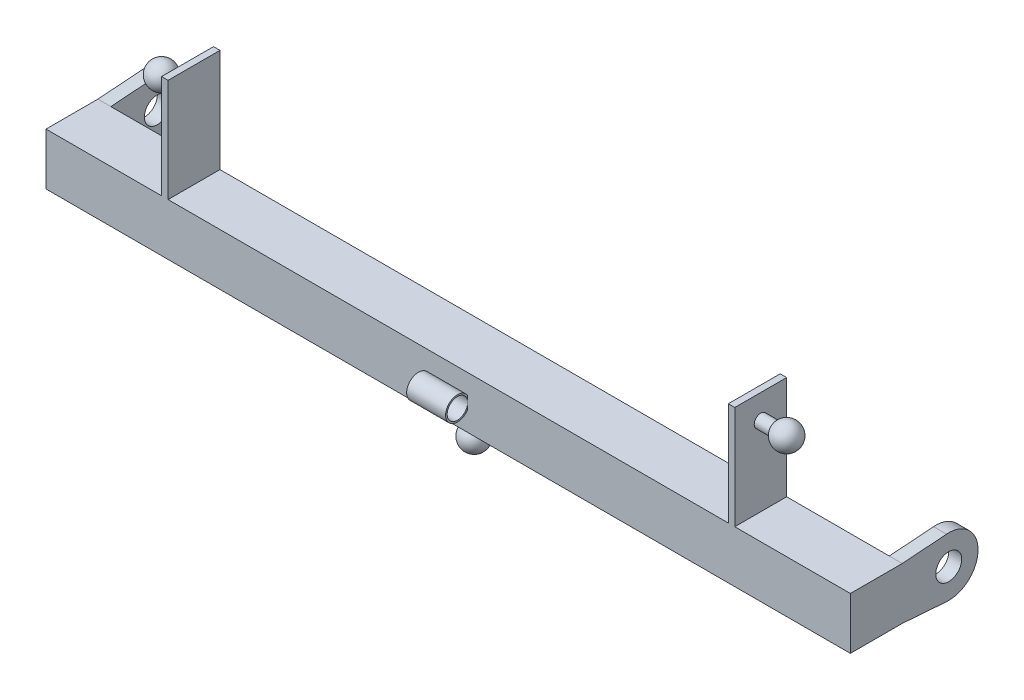
ISO-10303-21;
HEADER;
FILE_DESCRIPTION(('STEP AP214'),'2;1');
FILE_NAME('part.step','',(''),(''),'','','');
FILE_SCHEMA(('AUTOMOTIVE_DESIGN { 1 0 10303 214 1 1 1 1 }'));
ENDSEC;
DATA;
#1=APPLICATION_CONTEXT('core data for automotive mechanical design processes');
#2=APPLICATION_PROTOCOL_DEFINITION('international standard','automotive_design',2000,#1);
#3=PRODUCT_CONTEXT('',#1,'mechanical');
#4=PRODUCT('Part','Part','',(#3));
#5=PRODUCT_RELATED_PRODUCT_CATEGORY('part','',(#4));
#6=PRODUCT_DEFINITION_FORMATION('','',#4);
#7=PRODUCT_DEFINITION_CONTEXT('part definition',#1,'design');
#8=PRODUCT_DEFINITION('design','',#6,#7);
#9=PRODUCT_DEFINITION_SHAPE('','',#8);
#10=(LENGTH_UNIT() NAMED_UNIT(*) SI_UNIT(.MILLI.,.METRE.));
#11=(NAMED_UNIT(*) PLANE_ANGLE_UNIT() SI_UNIT($,.RADIAN.));
#12=(NAMED_UNIT(*) SI_UNIT($,.STERADIAN.) SOLID_ANGLE_UNIT());
#13=UNCERTAINTY_MEASURE_WITH_UNIT(LENGTH_MEASURE(1.E-05),#10,'distance_accuracy_value','');
#14=(GEOMETRIC_REPRESENTATION_CONTEXT(3) GLOBAL_UNCERTAINTY_ASSIGNED_CONTEXT((#13)) GLOBAL_UNIT_ASSIGNED_CONTEXT((#10,
#11,#12)) REPRESENTATION_CONTEXT('',''));
#15=CARTESIAN_POINT('',(0.,0.,0.));
#16=DIRECTION('',(0.,0.,1.));
#17=DIRECTION('',(1.,0.,0.));
#18=AXIS2_PLACEMENT_3D('',#15,#16,#17);
#19=CARTESIAN_POINT('',(381.,25.4,25.4));
#20=DIRECTION('',(0.,-1.,0.));
#21=DIRECTION('',(0.,0.,-1.));
#22=AXIS2_PLACEMENT_3D('',#19,#20,#21);
#23=PLANE('',#22);
#24=DIRECTION('',(0.,0.,-1.));
#25=VECTOR('',#24,1.);
#26=CARTESIAN_POINT('',(280.543,25.4,25.3999999999999));
#27=LINE('',#26,#25);
#28=CARTESIAN_POINT('',(280.543,25.4,25.4));
#29=VERTEX_POINT('',#28);
#30=CARTESIAN_POINT('',(280.543,25.4,-25.4));
#31=VERTEX_POINT('',#30);
#32=EDGE_CURVE('E62',#29,#31,#27,.T.);
#33=ORIENTED_EDGE('',*,*,#32,.F.);
#34=DIRECTION('',(-1.,0.,0.));
#35=VECTOR('',#34,1.);
#36=CARTESIAN_POINT('',(381.,25.4,25.4));
#37=LINE('',#36,#35);
#38=CARTESIAN_POINT('',(393.7,25.3999999999998,25.4000000000002));
#39=VERTEX_POINT('',#38);
#40=EDGE_CURVE('E432',#39,#29,#37,.T.);
#41=ORIENTED_EDGE('',*,*,#40,.F.);
#42=DIRECTION('',(0.,0.,1.));
#43=VECTOR('',#42,1.);
#44=CARTESIAN_POINT('',(393.7,25.3999999999998,25.4000000000002));
#45=LINE('',#44,#43);
#46=CARTESIAN_POINT('',(393.7,25.4000000000002,-25.3999999999998));
#47=VERTEX_POINT('',#46);
#48=EDGE_CURVE('E269',#47,#39,#45,.T.);
#49=ORIENTED_EDGE('',*,*,#48,.F.);
#50=DIRECTION('',(-1.,0.,0.));
#51=VECTOR('',#50,1.);
#52=CARTESIAN_POINT('',(393.7,25.4000000000002,-25.3999999999998));
#53=LINE('',#52,#51);
#54=CARTESIAN_POINT('',(381.,25.4000000000002,-25.3999999999998));
#55=VERTEX_POINT('',#54);
#56=EDGE_CURVE('E291',#47,#55,#53,.T.);
#57=ORIENTED_EDGE('',*,*,#56,.T.);
#58=DIRECTION('',(-1.,0.,0.));
#59=VECTOR('',#58,1.);
#60=CARTESIAN_POINT('',(381.,25.4,-25.4));
#61=LINE('',#60,#59);
#62=EDGE_CURVE('E435',#55,#31,#61,.T.);
#63=ORIENTED_EDGE('',*,*,#62,.T.);
#64=EDGE_LOOP('',(#33,#41,#49,#57,#63));
#65=FACE_BOUND('',#64,.T.);
#66=ADVANCED_FACE('F38',(#65),#23,.F.);
#67=DIRECTION('',(0.,0.,1.));
#68=VECTOR('',#67,1.);
#69=CARTESIAN_POINT('',(274.193,25.4,25.3999999999999));
#70=LINE('',#69,#68);
#71=CARTESIAN_POINT('',(274.193,25.4,-25.4000000000001));
#72=VERTEX_POINT('',#71);
#73=CARTESIAN_POINT('',(274.193,25.4,25.4));
#74=VERTEX_POINT('',#73);
#75=EDGE_CURVE('E313',#72,#74,#70,.T.);
#76=ORIENTED_EDGE('',*,*,#75,.F.);
#77=CARTESIAN_POINT('',(-274.193,25.4,-25.4));
#78=VERTEX_POINT('',#77);
#79=EDGE_CURVE('E436',#72,#78,#61,.T.);
#80=ORIENTED_EDGE('',*,*,#79,.T.);
#81=DIRECTION('',(0.,0.,-1.));
#82=VECTOR('',#81,1.);
#83=CARTESIAN_POINT('',(-274.193,25.4,25.4));
#84=LINE('',#83,#82);
#85=CARTESIAN_POINT('',(-274.193,25.4,25.4));
#86=VERTEX_POINT('',#85);
#87=EDGE_CURVE('E338',#86,#78,#84,.T.);
#88=ORIENTED_EDGE('',*,*,#87,.F.);
#89=EDGE_CURVE('E54',#74,#86,#37,.T.);
#90=ORIENTED_EDGE('',*,*,#89,.F.);
#91=EDGE_LOOP('',(#76,#80,#88,#90));
#92=FACE_BOUND('',#91,.T.);
#93=ADVANCED_FACE('F503',(#92),#23,.F.);
#94=DIRECTION('',(0.,0.,1.));
#95=VECTOR('',#94,1.);
#96=CARTESIAN_POINT('',(-280.543,25.4,25.4));
#97=LINE('',#96,#95);
#98=CARTESIAN_POINT('',(-280.543,25.4,-25.4));
#99=VERTEX_POINT('',#98);
#100=CARTESIAN_POINT('',(-280.543,25.4,25.4));
#101=VERTEX_POINT('',#100);
#102=EDGE_CURVE('E333',#99,#101,#97,.T.);
#103=ORIENTED_EDGE('',*,*,#102,.F.);
#104=CARTESIAN_POINT('',(-381.,25.4,-25.4));
#105=VERTEX_POINT('',#104);
#106=EDGE_CURVE('E434',#99,#105,#61,.T.);
#107=ORIENTED_EDGE('',*,*,#106,.T.);
#108=DIRECTION('',(1.,0.,0.));
#109=VECTOR('',#108,1.);
#110=CARTESIAN_POINT('',(-393.7,25.4000000000002,-25.3999999999998));
#111=LINE('',#110,#109);
#112=CARTESIAN_POINT('',(-393.7,25.4000000000002,-25.3999999999998));
#113=VERTEX_POINT('',#112);
#114=EDGE_CURVE('E253',#113,#105,#111,.T.);
#115=ORIENTED_EDGE('',*,*,#114,.F.);
#116=DIRECTION('',(0.,0.,1.));
#117=VECTOR('',#116,1.);
#118=CARTESIAN_POINT('',(-393.7,25.3999999999998,25.4000000000002));
#119=LINE('',#118,#117);
#120=CARTESIAN_POINT('',(-393.7,25.3999999999998,25.4000000000002));
#121=VERTEX_POINT('',#120);
#122=EDGE_CURVE('E242',#113,#121,#119,.T.);
#123=ORIENTED_EDGE('',*,*,#122,.T.);
#124=EDGE_CURVE('E431',#101,#121,#37,.T.);
#125=ORIENTED_EDGE('',*,*,#124,.F.);
#126=EDGE_LOOP('',(#103,#107,#115,#123,#125));
#127=FACE_BOUND('',#126,.T.);
#128=ADVANCED_FACE('F506',(#127),#23,.F.);
#129=CARTESIAN_POINT('',(381.,-25.4,25.4));
#130=DIRECTION('',(0.,0.,-1.));
#131=DIRECTION('',(-1.,0.,0.));
#132=AXIS2_PLACEMENT_3D('',#129,#130,#131);
#133=PLANE('',#132);
#134=DIRECTION('',(-1.,0.,0.));
#135=VECTOR('',#134,1.);
#136=CARTESIAN_POINT('',(19.05,5.85695157976361,25.4));
#137=LINE('',#136,#135);
#138=CARTESIAN_POINT('',(19.05,5.85695157976361,25.4));
#139=VERTEX_POINT('',#138);
#140=CARTESIAN_POINT('',(-19.05,5.85695157976361,25.4));
#141=VERTEX_POINT('',#140);
#142=EDGE_CURVE('E370',#139,#141,#137,.T.);
#143=ORIENTED_EDGE('',*,*,#142,.F.);
#144=DIRECTION('',(0.,-1.,0.));
#145=VECTOR('',#144,1.);
#146=CARTESIAN_POINT('',(19.05,-25.4,25.4));
#147=LINE('',#146,#145);
#148=CARTESIAN_POINT('',(19.05,0.,25.4));
#149=VERTEX_POINT('',#148);
#150=EDGE_CURVE('E384',#139,#149,#147,.T.);
#151=ORIENTED_EDGE('',*,*,#150,.T.);
#152=CARTESIAN_POINT('',(19.05,-5.85695157976361,25.4));
#153=VERTEX_POINT('',#152);
#154=EDGE_CURVE('E382',#149,#153,#147,.T.);
#155=ORIENTED_EDGE('',*,*,#154,.T.);
#156=DIRECTION('',(-1.,0.,0.));
#157=VECTOR('',#156,1.);
#158=CARTESIAN_POINT('',(19.05,-5.85695157976361,25.4));
#159=LINE('',#158,#157);
#160=CARTESIAN_POINT('',(-19.05,-5.85695157976361,25.4));
#161=VERTEX_POINT('',#160);
#162=EDGE_CURVE('E375',#161,#153,#159,.F.);
#163=ORIENTED_EDGE('',*,*,#162,.F.);
#164=DIRECTION('',(0.,-1.,0.));
#165=VECTOR('',#164,1.);
#166=CARTESIAN_POINT('',(-19.05,-25.4,25.4));
#167=LINE('',#166,#165);
#168=CARTESIAN_POINT('',(-19.05,0.,25.4));
#169=VERTEX_POINT('',#168);
#170=EDGE_CURVE('E378',#169,#161,#167,.T.);
#171=ORIENTED_EDGE('',*,*,#170,.F.);
#172=EDGE_CURVE('E381',#141,#169,#167,.T.);
#173=ORIENTED_EDGE('',*,*,#172,.F.);
#174=EDGE_LOOP('',(#143,#151,#155,#163,#171,#173));
#175=FACE_BOUND('',#174,.T.);
#176=ORIENTED_EDGE('',*,*,#124,.T.);
#177=DIRECTION('',(0.,-1.,0.));
#178=VECTOR('',#177,1.);
#179=CARTESIAN_POINT('',(-393.7,-25.4000000000002,25.3999999999998));
#180=LINE('',#179,#178);
#181=CARTESIAN_POINT('',(-393.7,-25.4000000000002,25.3999999999998));
#182=VERTEX_POINT('',#181);
#183=EDGE_CURVE('E236',#121,#182,#180,.T.);
#184=ORIENTED_EDGE('',*,*,#183,.T.);
#185=DIRECTION('',(-1.,0.,0.));
#186=VECTOR('',#185,1.);
#187=CARTESIAN_POINT('',(381.,-25.4,25.4));
#188=LINE('',#187,#186);
#189=CARTESIAN_POINT('',(393.7,-25.4000000000002,25.3999999999998));
#190=VERTEX_POINT('',#189);
#191=EDGE_CURVE('E429',#190,#182,#188,.T.);
#192=ORIENTED_EDGE('',*,*,#191,.F.);
#193=DIRECTION('',(0.,-1.,0.));
#194=VECTOR('',#193,1.);
#195=CARTESIAN_POINT('',(393.7,-25.4000000000002,25.3999999999998));
#196=LINE('',#195,#194);
#197=EDGE_CURVE('E272',#39,#190,#196,.T.);
#198=ORIENTED_EDGE('',*,*,#197,.F.);
#199=ORIENTED_EDGE('',*,*,#40,.T.);
#200=DIRECTION('',(0.,-1.,0.));
#201=VECTOR('',#200,1.);
#202=CARTESIAN_POINT('',(280.543,126.492,25.3999999999999));
#203=LINE('',#202,#201);
#204=CARTESIAN_POINT('',(280.543,126.492,25.3999999999999));
#205=VERTEX_POINT('',#204);
#206=EDGE_CURVE('E330',#205,#29,#203,.T.);
#207=ORIENTED_EDGE('',*,*,#206,.F.);
#208=DIRECTION('',(1.,0.,0.));
#209=VECTOR('',#208,1.);
#210=CARTESIAN_POINT('',(280.543,126.492,25.3999999999999));
#211=LINE('',#210,#209);
#212=CARTESIAN_POINT('',(274.193,126.492,25.3999999999999));
#213=VERTEX_POINT('',#212);
#214=EDGE_CURVE('E309',#213,#205,#211,.T.);
#215=ORIENTED_EDGE('',*,*,#214,.F.);
#216=DIRECTION('',(0.,-1.,0.));
#217=VECTOR('',#216,1.);
#218=CARTESIAN_POINT('',(274.193,126.492,25.3999999999999));
#219=LINE('',#218,#217);
#220=EDGE_CURVE('E319',#213,#74,#219,.T.);
#221=ORIENTED_EDGE('',*,*,#220,.T.);
#222=ORIENTED_EDGE('',*,*,#89,.T.);
#223=DIRECTION('',(0.,-1.,0.));
#224=VECTOR('',#223,1.);
#225=CARTESIAN_POINT('',(-274.193,126.492,25.4));
#226=LINE('',#225,#224);
#227=CARTESIAN_POINT('',(-274.193,126.492,25.4));
#228=VERTEX_POINT('',#227);
#229=EDGE_CURVE('E354',#228,#86,#226,.T.);
#230=ORIENTED_EDGE('',*,*,#229,.F.);
#231=DIRECTION('',(1.,0.,0.));
#232=VECTOR('',#231,1.);
#233=CARTESIAN_POINT('',(-280.543,126.492,25.4));
#234=LINE('',#233,#232);
#235=CARTESIAN_POINT('',(-280.543,126.492,25.4));
#236=VERTEX_POINT('',#235);
#237=EDGE_CURVE('E337',#236,#228,#234,.T.);
#238=ORIENTED_EDGE('',*,*,#237,.F.);
#239=DIRECTION('',(0.,-1.,0.));
#240=VECTOR('',#239,1.);
#241=CARTESIAN_POINT('',(-280.543,126.492,25.4));
#242=LINE('',#241,#240);
#243=EDGE_CURVE('E357',#236,#101,#242,.T.);
#244=ORIENTED_EDGE('',*,*,#243,.T.);
#245=EDGE_LOOP('',(#176,#184,#192,#198,#199,#207,#215,#221,#222,#230,#238,#244));
#246=FACE_BOUND('',#245,.T.);
#247=ADVANCED_FACE('F461',(#175,#246),#133,.F.);
#248=CARTESIAN_POINT('',(381.,-25.4,-25.4));
#249=DIRECTION('',(0.,0.,1.));
#250=DIRECTION('',(1.,0.,0.));
#251=AXIS2_PLACEMENT_3D('',#248,#249,#250);
#252=PLANE('',#251);
#253=DIRECTION('',(0.,1.,0.));
#254=VECTOR('',#253,1.);
#255=CARTESIAN_POINT('',(-381.,-25.4,-25.4));
#256=LINE('',#255,#254);
#257=CARTESIAN_POINT('',(-381.,-25.3999999999998,-25.4000000000002));
#258=VERTEX_POINT('',#257);
#259=EDGE_CURVE('E420',#258,#105,#256,.T.);
#260=ORIENTED_EDGE('',*,*,#259,.T.);
#261=ORIENTED_EDGE('',*,*,#106,.F.);
#262=DIRECTION('',(0.,-1.,0.));
#263=VECTOR('',#262,1.);
#264=CARTESIAN_POINT('',(-280.543,126.492,-25.4));
#265=LINE('',#264,#263);
#266=CARTESIAN_POINT('',(-280.543,126.492,-25.4));
#267=VERTEX_POINT('',#266);
#268=EDGE_CURVE('E344',#267,#99,#265,.T.);
#269=ORIENTED_EDGE('',*,*,#268,.F.);
#270=DIRECTION('',(-1.,0.,0.));
#271=VECTOR('',#270,1.);
#272=CARTESIAN_POINT('',(-280.543,126.492,-25.4));
#273=LINE('',#272,#271);
#274=CARTESIAN_POINT('',(-274.193,126.492,-25.4));
#275=VERTEX_POINT('',#274);
#276=EDGE_CURVE('E342',#275,#267,#273,.T.);
#277=ORIENTED_EDGE('',*,*,#276,.F.);
#278=DIRECTION('',(0.,-1.,0.));
#279=VECTOR('',#278,1.);
#280=CARTESIAN_POINT('',(-274.193,126.492,-25.4));
#281=LINE('',#280,#279);
#282=EDGE_CURVE('E351',#275,#78,#281,.T.);
#283=ORIENTED_EDGE('',*,*,#282,.T.);
#284=ORIENTED_EDGE('',*,*,#79,.F.);
#285=DIRECTION('',(0.,-1.,0.));
#286=VECTOR('',#285,1.);
#287=CARTESIAN_POINT('',(274.193,126.492,-25.4000000000001));
#288=LINE('',#287,#286);
#289=CARTESIAN_POINT('',(274.193,126.492,-25.4000000000001));
#290=VERTEX_POINT('',#289);
#291=EDGE_CURVE('E324',#290,#72,#288,.T.);
#292=ORIENTED_EDGE('',*,*,#291,.F.);
#293=DIRECTION('',(-1.,0.,0.));
#294=VECTOR('',#293,1.);
#295=CARTESIAN_POINT('',(280.543,126.492,-25.4000000000001));
#296=LINE('',#295,#294);
#297=CARTESIAN_POINT('',(280.543,126.492,-25.4000000000001));
#298=VERTEX_POINT('',#297);
#299=EDGE_CURVE('E315',#298,#290,#296,.T.);
#300=ORIENTED_EDGE('',*,*,#299,.F.);
#301=DIRECTION('',(0.,-1.,0.));
#302=VECTOR('',#301,1.);
#303=CARTESIAN_POINT('',(280.543,126.492,-25.4000000000001));
#304=LINE('',#303,#302);
#305=EDGE_CURVE('E327',#298,#31,#304,.T.);
#306=ORIENTED_EDGE('',*,*,#305,.T.);
#307=ORIENTED_EDGE('',*,*,#62,.F.);
#308=DIRECTION('',(0.,1.,0.));
#309=VECTOR('',#308,1.);
#310=CARTESIAN_POINT('',(381.,-25.4,-25.4));
#311=LINE('',#310,#309);
#312=CARTESIAN_POINT('',(381.,-25.4,-25.4));
#313=VERTEX_POINT('',#312);
#314=EDGE_CURVE('E421',#313,#55,#311,.T.);
#315=ORIENTED_EDGE('',*,*,#314,.F.);
#316=DIRECTION('',(-1.,0.,0.));
#317=VECTOR('',#316,1.);
#318=CARTESIAN_POINT('',(381.,-25.4,-25.4));
#319=LINE('',#318,#317);
#320=EDGE_CURVE('E424',#313,#258,#319,.T.);
#321=ORIENTED_EDGE('',*,*,#320,.T.);
#322=EDGE_LOOP('',(#260,#261,#269,#277,#283,#284,#292,#300,#306,#307,#315,#321));
#323=FACE_BOUND('',#322,.T.);
#324=ADVANCED_FACE('F40',(#323),#252,.F.);
#325=CARTESIAN_POINT('',(381.,-25.4,25.4));
#326=DIRECTION('',(0.,1.,0.));
#327=DIRECTION('',(0.,0.,1.));
#328=AXIS2_PLACEMENT_3D('',#325,#326,#327);
#329=PLANE('',#328);
#330=CARTESIAN_POINT('',(0.,-25.4,0.));
#331=DIRECTION('',(0.,1.,0.));
#332=DIRECTION('',(0.,0.,1.));
#333=AXIS2_PLACEMENT_3D('',#330,#331,#332);
#334=CIRCLE('',#333,6.34999999999999);
#335=CARTESIAN_POINT('',(0.,-25.4,6.34999999999999));
#336=VERTEX_POINT('',#335);
#337=EDGE_CURVE('E300',#336,#336,#334,.T.);
#338=ORIENTED_EDGE('',*,*,#337,.T.);
#339=EDGE_LOOP('',(#338));
#340=FACE_BOUND('',#339,.T.);
#341=ORIENTED_EDGE('',*,*,#191,.T.);
#342=DIRECTION('',(0.,0.,-1.));
#343=VECTOR('',#342,1.);
#344=CARTESIAN_POINT('',(-393.7,-25.3999999999998,-25.4000000000002));
#345=LINE('',#344,#343);
#346=CARTESIAN_POINT('',(-393.7,-25.3999999999998,-25.4000000000002));
#347=VERTEX_POINT('',#346);
#348=EDGE_CURVE('E234',#182,#347,#345,.T.);
#349=ORIENTED_EDGE('',*,*,#348,.T.);
#350=DIRECTION('',(1.,0.,0.));
#351=VECTOR('',#350,1.);
#352=CARTESIAN_POINT('',(-393.7,-25.3999999999998,-25.4000000000002));
#353=LINE('',#352,#351);
#354=EDGE_CURVE('E219',#347,#258,#353,.T.);
#355=ORIENTED_EDGE('',*,*,#354,.T.);
#356=ORIENTED_EDGE('',*,*,#320,.F.);
#357=DIRECTION('',(-1.,0.,0.));
#358=VECTOR('',#357,1.);
#359=CARTESIAN_POINT('',(393.7,-25.3999999999998,-25.4000000000002));
#360=LINE('',#359,#358);
#361=CARTESIAN_POINT('',(393.7,-25.3999999999998,-25.4000000000002));
#362=VERTEX_POINT('',#361);
#363=EDGE_CURVE('E288',#362,#313,#360,.T.);
#364=ORIENTED_EDGE('',*,*,#363,.F.);
#365=DIRECTION('',(0.,0.,-1.));
#366=VECTOR('',#365,1.);
#367=CARTESIAN_POINT('',(393.7,-25.3999999999998,-25.4000000000002));
#368=LINE('',#367,#366);
#369=EDGE_CURVE('E275',#190,#362,#368,.T.);
#370=ORIENTED_EDGE('',*,*,#369,.F.);
#371=EDGE_LOOP('',(#341,#349,#355,#356,#364,#370));
#372=FACE_BOUND('',#371,.T.);
#373=ADVANCED_FACE('F483',(#340,#372),#329,.F.);
#374=CARTESIAN_POINT('',(19.05,0.,35.4106222228962));
#375=DIRECTION('',(1.,0.,0.));
#376=DIRECTION('',(0.,0.,-1.));
#377=AXIS2_PLACEMENT_3D('',#374,#375,#376);
#378=PLANE('',#377);
#379=ORIENTED_EDGE('',*,*,#150,.F.);
#380=CARTESIAN_POINT('',(19.05,0.,35.4106222228962));
#381=DIRECTION('',(1.,0.,0.));
#382=DIRECTION('',(0.,0.,-1.));
#383=AXIS2_PLACEMENT_3D('',#380,#381,#382);
#384=CIRCLE('',#383,11.5981222228962);
#385=EDGE_CURVE('E367',#139,#153,#384,.T.);
#386=ORIENTED_EDGE('',*,*,#385,.T.);
#387=ORIENTED_EDGE('',*,*,#154,.F.);
#388=CARTESIAN_POINT('',(19.05,0.,35.4106222228962));
#389=DIRECTION('',(1.,0.,0.));
#390=DIRECTION('',(0.,0.,-1.));
#391=AXIS2_PLACEMENT_3D('',#388,#389,#390);
#392=CIRCLE('',#391,10.0106222228962);
#393=EDGE_CURVE('E361',#149,#149,#392,.T.);
#394=ORIENTED_EDGE('',*,*,#393,.F.);
#395=EDGE_LOOP('',(#379,#386,#387,#394));
#396=FACE_BOUND('',#395,.T.);
#397=ADVANCED_FACE('F535',(#396),#378,.T.);
#398=CARTESIAN_POINT('',(-19.05,0.,35.4106222228962));
#399=DIRECTION('',(1.,0.,0.));
#400=DIRECTION('',(0.,0.,-1.));
#401=AXIS2_PLACEMENT_3D('',#398,#399,#400);
#402=PLANE('',#401);
#403=CARTESIAN_POINT('',(-19.05,0.,35.4106222228962));
#404=DIRECTION('',(1.,0.,0.));
#405=DIRECTION('',(0.,0.,-1.));
#406=AXIS2_PLACEMENT_3D('',#403,#404,#405);
#407=CIRCLE('',#406,11.5981222228962);
#408=EDGE_CURVE('E364',#141,#161,#407,.T.);
#409=ORIENTED_EDGE('',*,*,#408,.F.);
#410=ORIENTED_EDGE('',*,*,#172,.T.);
#411=CARTESIAN_POINT('',(-19.05,0.,35.4106222228962));
#412=DIRECTION('',(1.,0.,0.));
#413=DIRECTION('',(0.,0.,-1.));
#414=AXIS2_PLACEMENT_3D('',#411,#412,#413);
#415=CIRCLE('',#414,10.0106222228962);
#416=EDGE_CURVE('E360',#169,#169,#415,.T.);
#417=ORIENTED_EDGE('',*,*,#416,.T.);
#418=ORIENTED_EDGE('',*,*,#170,.T.);
#419=EDGE_LOOP('',(#409,#410,#417,#418));
#420=FACE_BOUND('',#419,.T.);
#421=ADVANCED_FACE('F559',(#420),#402,.F.);
#422=CARTESIAN_POINT('',(19.05,0.,35.4106222228962));
#423=DIRECTION('',(-1.,0.,0.));
#424=DIRECTION('',(0.,0.,1.));
#425=AXIS2_PLACEMENT_3D('',#422,#423,#424);
#426=CYLINDRICAL_SURFACE('',#425,11.5981222228962);
#427=ORIENTED_EDGE('',*,*,#408,.T.);
#428=ORIENTED_EDGE('',*,*,#162,.T.);
#429=ORIENTED_EDGE('',*,*,#385,.F.);
#430=ORIENTED_EDGE('',*,*,#142,.T.);
#431=EDGE_LOOP('',(#427,#428,#429,#430));
#432=FACE_BOUND('',#431,.T.);
#433=ADVANCED_FACE('F555',(#432),#426,.T.);
#434=CARTESIAN_POINT('',(19.05,0.,35.4106222228962));
#435=DIRECTION('',(-1.,0.,0.));
#436=DIRECTION('',(0.,0.,1.));
#437=AXIS2_PLACEMENT_3D('',#434,#435,#436);
#438=CYLINDRICAL_SURFACE('',#437,10.0106222228962);
#439=ORIENTED_EDGE('',*,*,#393,.T.);
#440=EDGE_LOOP('',(#439));
#441=FACE_BOUND('',#440,.T.);
#442=ORIENTED_EDGE('',*,*,#416,.F.);
#443=EDGE_LOOP('',(#442));
#444=FACE_BOUND('',#443,.T.);
#445=ADVANCED_FACE('F558',(#441,#444),#438,.F.);
#446=CARTESIAN_POINT('',(-280.543,126.492,25.4));
#447=DIRECTION('',(1.,0.,0.));
#448=DIRECTION('',(0.,0.,-1.));
#449=AXIS2_PLACEMENT_3D('',#446,#447,#448);
#450=PLANE('',#449);
#451=CARTESIAN_POINT('',(-280.543,102.616,0.));
#452=DIRECTION('',(1.,0.,0.));
#453=DIRECTION('',(0.,0.,-1.));
#454=AXIS2_PLACEMENT_3D('',#451,#452,#453);
#455=CIRCLE('',#454,6.34999999999999);
#456=CARTESIAN_POINT('',(-280.543,102.616,-6.34999999999999));
#457=VERTEX_POINT('',#456);
#458=EDGE_CURVE('E11',#457,#457,#455,.F.);
#459=ORIENTED_EDGE('',*,*,#458,.F.);
#460=EDGE_LOOP('',(#459));
#461=FACE_BOUND('',#460,.T.);
#462=ORIENTED_EDGE('',*,*,#102,.T.);
#463=ORIENTED_EDGE('',*,*,#243,.F.);
#464=DIRECTION('',(0.,0.,1.));
#465=VECTOR('',#464,1.);
#466=CARTESIAN_POINT('',(-280.543,126.492,25.4));
#467=LINE('',#466,#465);
#468=EDGE_CURVE('E334',#267,#236,#467,.T.);
#469=ORIENTED_EDGE('',*,*,#468,.F.);
#470=ORIENTED_EDGE('',*,*,#268,.T.);
#471=EDGE_LOOP('',(#462,#463,#469,#470));
#472=FACE_BOUND('',#471,.T.);
#473=ADVANCED_FACE('F495',(#461,#472),#450,.F.);
#474=CARTESIAN_POINT('',(-274.193,126.492,25.4));
#475=DIRECTION('',(-1.,0.,0.));
#476=DIRECTION('',(0.,0.,1.));
#477=AXIS2_PLACEMENT_3D('',#474,#475,#476);
#478=PLANE('',#477);
#479=ORIENTED_EDGE('',*,*,#87,.T.);
#480=ORIENTED_EDGE('',*,*,#282,.F.);
#481=DIRECTION('',(0.,0.,-1.));
#482=VECTOR('',#481,1.);
#483=CARTESIAN_POINT('',(-274.193,126.492,25.4));
#484=LINE('',#483,#482);
#485=EDGE_CURVE('E340',#228,#275,#484,.T.);
#486=ORIENTED_EDGE('',*,*,#485,.F.);
#487=ORIENTED_EDGE('',*,*,#229,.T.);
#488=EDGE_LOOP('',(#479,#480,#486,#487));
#489=FACE_BOUND('',#488,.T.);
#490=ADVANCED_FACE('F502',(#489),#478,.F.);
#491=CARTESIAN_POINT('',(0.,126.492,0.));
#492=DIRECTION('',(0.,-1.,0.));
#493=DIRECTION('',(0.,0.,-1.));
#494=AXIS2_PLACEMENT_3D('',#491,#492,#493);
#495=PLANE('',#494);
#496=ORIENTED_EDGE('',*,*,#468,.T.);
#497=ORIENTED_EDGE('',*,*,#237,.T.);
#498=ORIENTED_EDGE('',*,*,#485,.T.);
#499=ORIENTED_EDGE('',*,*,#276,.T.);
#500=EDGE_LOOP('',(#496,#497,#498,#499));
#501=FACE_BOUND('',#500,.T.);
#502=ADVANCED_FACE('F447',(#501),#495,.F.);
#503=CARTESIAN_POINT('',(280.543,126.492,25.3999999999999));
#504=DIRECTION('',(-1.,0.,0.));
#505=DIRECTION('',(0.,0.,1.));
#506=AXIS2_PLACEMENT_3D('',#503,#504,#505);
#507=PLANE('',#506);
#508=CARTESIAN_POINT('',(280.543,102.616,0.));
#509=DIRECTION('',(-1.,0.,0.));
#510=DIRECTION('',(0.,0.,1.));
#511=AXIS2_PLACEMENT_3D('',#508,#509,#510);
#512=CIRCLE('',#511,6.34999999999999);
#513=CARTESIAN_POINT('',(280.543,102.616,6.34999999999999));
#514=VERTEX_POINT('',#513);
#515=EDGE_CURVE('E47',#514,#514,#512,.F.);
#516=ORIENTED_EDGE('',*,*,#515,.F.);
#517=EDGE_LOOP('',(#516));
#518=FACE_BOUND('',#517,.T.);
#519=ORIENTED_EDGE('',*,*,#32,.T.);
#520=ORIENTED_EDGE('',*,*,#305,.F.);
#521=DIRECTION('',(0.,0.,-1.));
#522=VECTOR('',#521,1.);
#523=CARTESIAN_POINT('',(280.543,126.492,25.3999999999999));
#524=LINE('',#523,#522);
#525=EDGE_CURVE('E312',#205,#298,#524,.T.);
#526=ORIENTED_EDGE('',*,*,#525,.F.);
#527=ORIENTED_EDGE('',*,*,#206,.T.);
#528=EDGE_LOOP('',(#519,#520,#526,#527));
#529=FACE_BOUND('',#528,.T.);
#530=ADVANCED_FACE('F443',(#518,#529),#507,.F.);
#531=CARTESIAN_POINT('',(274.193,126.492,25.3999999999999));
#532=DIRECTION('',(1.,0.,0.));
#533=DIRECTION('',(0.,0.,-1.));
#534=AXIS2_PLACEMENT_3D('',#531,#532,#533);
#535=PLANE('',#534);
#536=ORIENTED_EDGE('',*,*,#75,.T.);
#537=ORIENTED_EDGE('',*,*,#220,.F.);
#538=DIRECTION('',(0.,0.,1.));
#539=VECTOR('',#538,1.);
#540=CARTESIAN_POINT('',(274.193,126.492,25.3999999999999));
#541=LINE('',#540,#539);
#542=EDGE_CURVE('E317',#290,#213,#541,.T.);
#543=ORIENTED_EDGE('',*,*,#542,.F.);
#544=ORIENTED_EDGE('',*,*,#291,.T.);
#545=EDGE_LOOP('',(#536,#537,#543,#544));
#546=FACE_BOUND('',#545,.T.);
#547=ADVANCED_FACE('F446',(#546),#535,.F.);
#548=CARTESIAN_POINT('',(0.,126.492,0.));
#549=DIRECTION('',(0.,-1.,0.));
#550=DIRECTION('',(0.,0.,-1.));
#551=AXIS2_PLACEMENT_3D('',#548,#549,#550);
#552=PLANE('',#551);
#553=ORIENTED_EDGE('',*,*,#214,.T.);
#554=ORIENTED_EDGE('',*,*,#525,.T.);
#555=ORIENTED_EDGE('',*,*,#299,.T.);
#556=ORIENTED_EDGE('',*,*,#542,.T.);
#557=EDGE_LOOP('',(#553,#554,#555,#556));
#558=FACE_BOUND('',#557,.T.);
#559=ADVANCED_FACE('F457',(#558),#552,.F.);
#560=CARTESIAN_POINT('',(305.943,102.616,0.));
#561=DIRECTION('',(-1.,0.,0.));
#562=DIRECTION('',(0.,1.,0.));
#563=AXIS2_PLACEMENT_3D('',#560,#561,#562);
#564=SPHERICAL_SURFACE('',#563,12.7);
#565=CARTESIAN_POINT('',(294.944477371938,102.616,0.));
#566=DIRECTION('',(-1.,0.,0.));
#567=DIRECTION('',(0.,-1.,0.));
#568=AXIS2_PLACEMENT_3D('',#565,#566,#567);
#569=CIRCLE('',#568,6.35);
#570=CARTESIAN_POINT('',(294.944477371938,96.266,0.));
#571=VERTEX_POINT('',#570);
#572=EDGE_CURVE('E306',#571,#571,#569,.T.);
#573=ORIENTED_EDGE('',*,*,#572,.F.);
#574=EDGE_LOOP('',(#573));
#575=FACE_BOUND('',#574,.T.);
#576=ADVANCED_FACE('F581',(#575),#564,.T.);
#577=CARTESIAN_POINT('',(280.543,102.616,0.));
#578=DIRECTION('',(-1.,0.,0.));
#579=DIRECTION('',(0.,-1.,0.));
#580=AXIS2_PLACEMENT_3D('',#577,#578,#579);
#581=CYLINDRICAL_SURFACE('',#580,6.34999999999999);
#582=ORIENTED_EDGE('',*,*,#515,.T.);
#583=EDGE_LOOP('',(#582));
#584=FACE_BOUND('',#583,.T.);
#585=ORIENTED_EDGE('',*,*,#572,.T.);
#586=EDGE_LOOP('',(#585));
#587=FACE_BOUND('',#586,.T.);
#588=ADVANCED_FACE('F440',(#584,#587),#581,.T.);
#589=CARTESIAN_POINT('',(-305.943,102.616,0.));
#590=DIRECTION('',(1.,0.,0.));
#591=DIRECTION('',(0.,1.,0.));
#592=AXIS2_PLACEMENT_3D('',#589,#590,#591);
#593=SPHERICAL_SURFACE('',#592,12.7);
#594=CARTESIAN_POINT('',(-294.944477371938,102.616,0.));
#595=DIRECTION('',(-1.,0.,0.));
#596=DIRECTION('',(0.,-1.,0.));
#597=AXIS2_PLACEMENT_3D('',#594,#595,#596);
#598=CIRCLE('',#597,6.35);
#599=CARTESIAN_POINT('',(-294.944477371938,96.266,0.));
#600=VERTEX_POINT('',#599);
#601=EDGE_CURVE('E303',#600,#600,#598,.T.);
#602=ORIENTED_EDGE('',*,*,#601,.T.);
#603=EDGE_LOOP('',(#602));
#604=FACE_BOUND('',#603,.T.);
#605=ADVANCED_FACE('F587',(#604),#593,.T.);
#606=CARTESIAN_POINT('',(-280.543,102.616,0.));
#607=DIRECTION('',(1.,0.,0.));
#608=DIRECTION('',(0.,-1.,0.));
#609=AXIS2_PLACEMENT_3D('',#606,#607,#608);
#610=CYLINDRICAL_SURFACE('',#609,6.34999999999999);
#611=ORIENTED_EDGE('',*,*,#458,.T.);
#612=EDGE_LOOP('',(#611));
#613=FACE_BOUND('',#612,.T.);
#614=ORIENTED_EDGE('',*,*,#601,.F.);
#615=EDGE_LOOP('',(#614));
#616=FACE_BOUND('',#615,.T.);
#617=ADVANCED_FACE('F590',(#613,#616),#610,.T.);
#618=CARTESIAN_POINT('',(0.,-25.4,0.));
#619=DIRECTION('',(0.,1.,0.));
#620=DIRECTION('',(0.,0.,1.));
#621=AXIS2_PLACEMENT_3D('',#618,#619,#620);
#622=CYLINDRICAL_SURFACE('',#621,6.34999999999999);
#623=CARTESIAN_POINT('',(0.,-39.8014773719376,0.));
#624=DIRECTION('',(0.,1.,0.));
#625=DIRECTION('',(0.,0.,1.));
#626=AXIS2_PLACEMENT_3D('',#623,#624,#625);
#627=CIRCLE('',#626,6.34999999999999);
#628=CARTESIAN_POINT('',(0.,-39.8014773719376,6.34999999999999));
#629=VERTEX_POINT('',#628);
#630=EDGE_CURVE('E297',#629,#629,#627,.T.);
#631=ORIENTED_EDGE('',*,*,#630,.T.);
#632=EDGE_LOOP('',(#631));
#633=FACE_BOUND('',#632,.T.);
#634=ORIENTED_EDGE('',*,*,#337,.F.);
#635=EDGE_LOOP('',(#634));
#636=FACE_BOUND('',#635,.T.);
#637=ADVANCED_FACE('F594',(#633,#636),#622,.T.);
#638=CARTESIAN_POINT('',(0.,-50.8,0.));
#639=DIRECTION('',(0.,1.,0.));
#640=DIRECTION('',(0.,0.,1.));
#641=AXIS2_PLACEMENT_3D('',#638,#639,#640);
#642=SPHERICAL_SURFACE('',#641,12.7);
#643=ORIENTED_EDGE('',*,*,#630,.F.);
#644=EDGE_LOOP('',(#643));
#645=FACE_BOUND('',#644,.T.);
#646=ADVANCED_FACE('F598',(#645),#642,.T.);
#647=CARTESIAN_POINT('',(381.,-5.43306156901821E-11,-70.8646313695298));
#648=DIRECTION('',(1.,0.,0.));
#649=DIRECTION('',(0.,0.,-1.));
#650=AXIS2_PLACEMENT_3D('',#647,#648,#649);
#651=PLANE('',#650);
#652=CARTESIAN_POINT('',(381.,-5.43306156901821E-11,-70.8646313695298));
#653=DIRECTION('',(1.,0.,0.));
#654=DIRECTION('',(0.,0.,-1.));
#655=AXIS2_PLACEMENT_3D('',#652,#653,#654);
#656=CIRCLE('',#655,12.7);
#657=CARTESIAN_POINT('',(381.,-5.43306156901821E-11,-83.5646313695298));
#658=VERTEX_POINT('',#657);
#659=EDGE_CURVE('E218',#658,#658,#656,.T.);
#660=ORIENTED_EDGE('',*,*,#659,.T.);
#661=EDGE_LOOP('',(#660));
#662=FACE_BOUND('',#661,.T.);
#663=DIRECTION('',(0.,-0.074879043594435,-0.997192623734443));
#664=VECTOR('',#663,1.);
#665=CARTESIAN_POINT('',(381.,-28.6523763005199,-68.7131287580765));
#666=LINE('',#665,#664);
#667=CARTESIAN_POINT('',(381.,-28.6523763005199,-68.7131287580765));
#668=VERTEX_POINT('',#667);
#669=EDGE_CURVE('E267',#313,#668,#666,.T.);
#670=ORIENTED_EDGE('',*,*,#669,.F.);
#671=ORIENTED_EDGE('',*,*,#314,.T.);
#672=DIRECTION('',(0.,-0.0748790435919386,0.997192623734631));
#673=VECTOR('',#672,1.);
#674=CARTESIAN_POINT('',(381.,25.4000000000002,-25.3999999999998));
#675=LINE('',#674,#673);
#676=CARTESIAN_POINT('',(381.,28.6523763004167,-68.7131287581482));
#677=VERTEX_POINT('',#676);
#678=EDGE_CURVE('E282',#677,#55,#675,.T.);
#679=ORIENTED_EDGE('',*,*,#678,.F.);
#680=CARTESIAN_POINT('',(381.,-5.43306156901821E-11,-70.8646313695298));
#681=DIRECTION('',(1.,0.,0.));
#682=DIRECTION('',(0.,0.,-1.));
#683=AXIS2_PLACEMENT_3D('',#680,#681,#682);
#684=CIRCLE('',#683,28.7330407571244);
#685=EDGE_CURVE('E260',#668,#677,#684,.T.);
#686=ORIENTED_EDGE('',*,*,#685,.F.);
#687=EDGE_LOOP('',(#670,#671,#679,#686));
#688=FACE_BOUND('',#687,.T.);
#689=ADVANCED_FACE('F476',(#662,#688),#651,.F.);
#690=CARTESIAN_POINT('',(393.7,-5.43306156901821E-11,-70.8646313695298));
#691=DIRECTION('',(1.,0.,0.));
#692=DIRECTION('',(0.,0.,-1.));
#693=AXIS2_PLACEMENT_3D('',#690,#691,#692);
#694=PLANE('',#693);
#695=CARTESIAN_POINT('',(393.7,-5.43306156901821E-11,-70.8646313695298));
#696=DIRECTION('',(1.,0.,0.));
#697=DIRECTION('',(0.,0.,-1.));
#698=AXIS2_PLACEMENT_3D('',#695,#696,#697);
#699=CIRCLE('',#698,28.7330407571244);
#700=CARTESIAN_POINT('',(393.7,-28.6523763005199,-68.7131287580765));
#701=VERTEX_POINT('',#700);
#702=CARTESIAN_POINT('',(393.7,28.6523763004167,-68.7131287581482));
#703=VERTEX_POINT('',#702);
#704=EDGE_CURVE('E263',#701,#703,#699,.T.);
#705=ORIENTED_EDGE('',*,*,#704,.T.);
#706=DIRECTION('',(0.,-0.0748790435919386,0.997192623734631));
#707=VECTOR('',#706,1.);
#708=CARTESIAN_POINT('',(393.7,25.4000000000002,-25.3999999999998));
#709=LINE('',#708,#707);
#710=EDGE_CURVE('E266',#703,#47,#709,.T.);
#711=ORIENTED_EDGE('',*,*,#710,.T.);
#712=ORIENTED_EDGE('',*,*,#48,.T.);
#713=ORIENTED_EDGE('',*,*,#197,.T.);
#714=ORIENTED_EDGE('',*,*,#369,.T.);
#715=DIRECTION('',(0.,-0.074879043594435,-0.997192623734443));
#716=VECTOR('',#715,1.);
#717=CARTESIAN_POINT('',(393.7,-28.6523763005199,-68.7131287580765));
#718=LINE('',#717,#716);
#719=EDGE_CURVE('E277',#362,#701,#718,.T.);
#720=ORIENTED_EDGE('',*,*,#719,.T.);
#721=EDGE_LOOP('',(#705,#711,#712,#713,#714,#720));
#722=FACE_BOUND('',#721,.T.);
#723=CARTESIAN_POINT('',(393.7,-5.43306156901821E-11,-70.8646313695298));
#724=DIRECTION('',(1.,0.,0.));
#725=DIRECTION('',(0.,0.,-1.));
#726=AXIS2_PLACEMENT_3D('',#723,#724,#725);
#727=CIRCLE('',#726,12.7);
#728=CARTESIAN_POINT('',(393.7,-5.43306156901821E-11,-83.5646313695298));
#729=VERTEX_POINT('',#728);
#730=EDGE_CURVE('E257',#729,#729,#727,.T.);
#731=ORIENTED_EDGE('',*,*,#730,.F.);
#732=EDGE_LOOP('',(#731));
#733=FACE_BOUND('',#732,.T.);
#734=ADVANCED_FACE('F465',(#722,#733),#694,.T.);
#735=CARTESIAN_POINT('',(393.7,-5.43306156901821E-11,-70.8646313695298));
#736=DIRECTION('',(-1.,0.,0.));
#737=DIRECTION('',(0.,0.,1.));
#738=AXIS2_PLACEMENT_3D('',#735,#736,#737);
#739=CYLINDRICAL_SURFACE('',#738,28.7330407571244);
#740=ORIENTED_EDGE('',*,*,#685,.T.);
#741=DIRECTION('',(-1.,0.,0.));
#742=VECTOR('',#741,1.);
#743=CARTESIAN_POINT('',(393.7,28.6523763004167,-68.7131287581482));
#744=LINE('',#743,#742);
#745=EDGE_CURVE('E294',#703,#677,#744,.T.);
#746=ORIENTED_EDGE('',*,*,#745,.F.);
#747=ORIENTED_EDGE('',*,*,#704,.F.);
#748=DIRECTION('',(-1.,0.,0.));
#749=VECTOR('',#748,1.);
#750=CARTESIAN_POINT('',(393.7,-28.6523763005199,-68.7131287580765));
#751=LINE('',#750,#749);
#752=EDGE_CURVE('E279',#701,#668,#751,.T.);
#753=ORIENTED_EDGE('',*,*,#752,.T.);
#754=EDGE_LOOP('',(#740,#746,#747,#753));
#755=FACE_BOUND('',#754,.T.);
#756=ADVANCED_FACE('F603',(#755),#739,.T.);
#757=CARTESIAN_POINT('',(393.7,25.4000000000002,-25.3999999999998));
#758=DIRECTION('',(0.,-0.997192623734631,-0.0748790435919386));
#759=DIRECTION('',(0.,0.0748790435919387,-0.997192623734631));
#760=AXIS2_PLACEMENT_3D('',#757,#758,#759);
#761=PLANE('',#760);
#762=ORIENTED_EDGE('',*,*,#678,.T.);
#763=ORIENTED_EDGE('',*,*,#56,.F.);
#764=ORIENTED_EDGE('',*,*,#710,.F.);
#765=ORIENTED_EDGE('',*,*,#745,.T.);
#766=EDGE_LOOP('',(#762,#763,#764,#765));
#767=FACE_BOUND('',#766,.T.);
#768=ADVANCED_FACE('F472',(#767),#761,.F.);
#769=CARTESIAN_POINT('',(393.7,-28.6523763005199,-68.7131287580765));
#770=DIRECTION('',(0.,0.997192623734443,-0.074879043594435));
#771=DIRECTION('',(0.,0.074879043594435,0.997192623734443));
#772=AXIS2_PLACEMENT_3D('',#769,#770,#771);
#773=PLANE('',#772);
#774=ORIENTED_EDGE('',*,*,#669,.T.);
#775=ORIENTED_EDGE('',*,*,#752,.F.);
#776=ORIENTED_EDGE('',*,*,#719,.F.);
#777=ORIENTED_EDGE('',*,*,#363,.T.);
#778=EDGE_LOOP('',(#774,#775,#776,#777));
#779=FACE_BOUND('',#778,.T.);
#780=ADVANCED_FACE('F480',(#779),#773,.F.);
#781=CARTESIAN_POINT('',(393.7,-5.43306156901821E-11,-70.8646313695298));
#782=DIRECTION('',(-1.,0.,0.));
#783=DIRECTION('',(0.,0.,1.));
#784=AXIS2_PLACEMENT_3D('',#781,#782,#783);
#785=CYLINDRICAL_SURFACE('',#784,12.7);
#786=ORIENTED_EDGE('',*,*,#730,.T.);
#787=EDGE_LOOP('',(#786));
#788=FACE_BOUND('',#787,.T.);
#789=ORIENTED_EDGE('',*,*,#659,.F.);
#790=EDGE_LOOP('',(#789));
#791=FACE_BOUND('',#790,.T.);
#792=ADVANCED_FACE('F611',(#788,#791),#785,.F.);
#793=CARTESIAN_POINT('',(-393.7,-5.43306156901821E-11,-70.8646313695298));
#794=DIRECTION('',(1.,0.,0.));
#795=DIRECTION('',(0.,0.,-1.));
#796=AXIS2_PLACEMENT_3D('',#793,#794,#795);
#797=CYLINDRICAL_SURFACE('',#796,28.7330407571244);
#798=CARTESIAN_POINT('',(-381.,-5.43306156901821E-11,-70.8646313695298));
#799=DIRECTION('',(1.,0.,0.));
#800=DIRECTION('',(0.,0.,-1.));
#801=AXIS2_PLACEMENT_3D('',#798,#799,#800);
#802=CIRCLE('',#801,28.7330407571244);
#803=CARTESIAN_POINT('',(-381.,-28.6523763005199,-68.7131287580765));
#804=VERTEX_POINT('',#803);
#805=CARTESIAN_POINT('',(-381.,28.6523763004167,-68.7131287581482));
#806=VERTEX_POINT('',#805);
#807=EDGE_CURVE('E213',#804,#806,#802,.T.);
#808=ORIENTED_EDGE('',*,*,#807,.F.);
#809=DIRECTION('',(1.,0.,0.));
#810=VECTOR('',#809,1.);
#811=CARTESIAN_POINT('',(-393.7,-28.6523763005199,-68.7131287580765));
#812=LINE('',#811,#810);
#813=CARTESIAN_POINT('',(-393.7,-28.6523763005199,-68.7131287580765));
#814=VERTEX_POINT('',#813);
#815=EDGE_CURVE('E207',#814,#804,#812,.T.);
#816=ORIENTED_EDGE('',*,*,#815,.F.);
#817=CARTESIAN_POINT('',(-393.7,-5.43306156901821E-11,-70.8646313695298));
#818=DIRECTION('',(1.,0.,0.));
#819=DIRECTION('',(0.,0.,-1.));
#820=AXIS2_PLACEMENT_3D('',#817,#818,#819);
#821=CIRCLE('',#820,28.7330407571244);
#822=CARTESIAN_POINT('',(-393.7,28.6523763004167,-68.7131287581482));
#823=VERTEX_POINT('',#822);
#824=EDGE_CURVE('E210',#814,#823,#821,.T.);
#825=ORIENTED_EDGE('',*,*,#824,.T.);
#826=DIRECTION('',(1.,0.,0.));
#827=VECTOR('',#826,1.);
#828=CARTESIAN_POINT('',(-393.7,28.6523763004167,-68.7131287581482));
#829=LINE('',#828,#827);
#830=EDGE_CURVE('E246',#823,#806,#829,.T.);
#831=ORIENTED_EDGE('',*,*,#830,.T.);
#832=EDGE_LOOP('',(#808,#816,#825,#831));
#833=FACE_BOUND('',#832,.T.);
#834=ADVANCED_FACE('F209',(#833),#797,.T.);
#835=CARTESIAN_POINT('',(-393.7,-28.6523763005199,-68.7131287580765));
#836=DIRECTION('',(0.,-0.997192623734443,0.074879043594435));
#837=DIRECTION('',(0.,-0.074879043594435,-0.997192623734443));
#838=AXIS2_PLACEMENT_3D('',#835,#836,#837);
#839=PLANE('',#838);
#840=DIRECTION('',(0.,-0.074879043594435,-0.997192623734443));
#841=VECTOR('',#840,1.);
#842=CARTESIAN_POINT('',(-381.,-28.6523763005199,-68.7131287580765));
#843=LINE('',#842,#841);
#844=EDGE_CURVE('E248',#258,#804,#843,.T.);
#845=ORIENTED_EDGE('',*,*,#844,.F.);
#846=ORIENTED_EDGE('',*,*,#354,.F.);
#847=DIRECTION('',(0.,-0.074879043594435,-0.997192623734443));
#848=VECTOR('',#847,1.);
#849=CARTESIAN_POINT('',(-393.7,-28.6523763005199,-68.7131287580765));
#850=LINE('',#849,#848);
#851=EDGE_CURVE('E225',#347,#814,#850,.T.);
#852=ORIENTED_EDGE('',*,*,#851,.T.);
#853=ORIENTED_EDGE('',*,*,#815,.T.);
#854=EDGE_LOOP('',(#845,#846,#852,#853));
#855=FACE_BOUND('',#854,.T.);
#856=ADVANCED_FACE('F232',(#855),#839,.T.);
#857=CARTESIAN_POINT('',(-393.7,25.4000000000002,-25.3999999999998));
#858=DIRECTION('',(0.,0.997192623734631,0.0748790435919386));
#859=DIRECTION('',(0.,-0.0748790435919387,0.997192623734631));
#860=AXIS2_PLACEMENT_3D('',#857,#858,#859);
#861=PLANE('',#860);
#862=DIRECTION('',(0.,-0.0748790435919386,0.997192623734631));
#863=VECTOR('',#862,1.);
#864=CARTESIAN_POINT('',(-381.,25.4000000000002,-25.3999999999998));
#865=LINE('',#864,#863);
#866=EDGE_CURVE('E230',#806,#105,#865,.T.);
#867=ORIENTED_EDGE('',*,*,#866,.F.);
#868=ORIENTED_EDGE('',*,*,#830,.F.);
#869=DIRECTION('',(0.,-0.0748790435919386,0.997192623734631));
#870=VECTOR('',#869,1.);
#871=CARTESIAN_POINT('',(-393.7,25.4000000000002,-25.3999999999998));
#872=LINE('',#871,#870);
#873=EDGE_CURVE('E229',#823,#113,#872,.T.);
#874=ORIENTED_EDGE('',*,*,#873,.T.);
#875=ORIENTED_EDGE('',*,*,#114,.T.);
#876=EDGE_LOOP('',(#867,#868,#874,#875));
#877=FACE_BOUND('',#876,.T.);
#878=ADVANCED_FACE('F508',(#877),#861,.T.);
#879=CARTESIAN_POINT('',(-393.7,-5.43306156901821E-11,-70.8646313695298));
#880=DIRECTION('',(-1.,0.,0.));
#881=DIRECTION('',(0.,0.,-1.));
#882=AXIS2_PLACEMENT_3D('',#879,#880,#881);
#883=PLANE('',#882);
#884=CARTESIAN_POINT('',(-393.7,-5.43306156901821E-11,-70.8646313695298));
#885=DIRECTION('',(1.,0.,0.));
#886=DIRECTION('',(0.,0.,-1.));
#887=AXIS2_PLACEMENT_3D('',#884,#885,#886);
#888=CIRCLE('',#887,12.7);
#889=CARTESIAN_POINT('',(-393.7,-5.43306156901821E-11,-83.5646313695298));
#890=VERTEX_POINT('',#889);
#891=EDGE_CURVE('E249',#890,#890,#888,.T.);
#892=ORIENTED_EDGE('',*,*,#891,.T.);
#893=EDGE_LOOP('',(#892));
#894=FACE_BOUND('',#893,.T.);
#895=ORIENTED_EDGE('',*,*,#824,.F.);
#896=ORIENTED_EDGE('',*,*,#851,.F.);
#897=ORIENTED_EDGE('',*,*,#348,.F.);
#898=ORIENTED_EDGE('',*,*,#183,.F.);
#899=ORIENTED_EDGE('',*,*,#122,.F.);
#900=ORIENTED_EDGE('',*,*,#873,.F.);
#901=EDGE_LOOP('',(#895,#896,#897,#898,#899,#900));
#902=FACE_BOUND('',#901,.T.);
#903=ADVANCED_FACE('F223',(#894,#902),#883,.T.);
#904=CARTESIAN_POINT('',(-381.,-5.43306156901821E-11,-70.8646313695298));
#905=DIRECTION('',(-1.,0.,0.));
#906=DIRECTION('',(0.,0.,-1.));
#907=AXIS2_PLACEMENT_3D('',#904,#905,#906);
#908=PLANE('',#907);
#909=ORIENTED_EDGE('',*,*,#259,.F.);
#910=ORIENTED_EDGE('',*,*,#844,.T.);
#911=ORIENTED_EDGE('',*,*,#807,.T.);
#912=ORIENTED_EDGE('',*,*,#866,.T.);
#913=EDGE_LOOP('',(#909,#910,#911,#912));
#914=FACE_BOUND('',#913,.T.);
#915=CARTESIAN_POINT('',(-381.,-5.43306156901821E-11,-70.8646313695298));
#916=DIRECTION('',(1.,0.,0.));
#917=DIRECTION('',(0.,0.,-1.));
#918=AXIS2_PLACEMENT_3D('',#915,#916,#917);
#919=CIRCLE('',#918,12.7);
#920=CARTESIAN_POINT('',(-381.,-5.43306156901821E-11,-83.5646313695298));
#921=VERTEX_POINT('',#920);
#922=EDGE_CURVE('E905',#921,#921,#919,.T.);
#923=ORIENTED_EDGE('',*,*,#922,.F.);
#924=EDGE_LOOP('',(#923));
#925=FACE_BOUND('',#924,.T.);
#926=ADVANCED_FACE('F485',(#914,#925),#908,.F.);
#927=CARTESIAN_POINT('',(-393.7,-5.43306156901821E-11,-70.8646313695298));
#928=DIRECTION('',(1.,0.,0.));
#929=DIRECTION('',(0.,0.,-1.));
#930=AXIS2_PLACEMENT_3D('',#927,#928,#929);
#931=CYLINDRICAL_SURFACE('',#930,12.7);
#932=ORIENTED_EDGE('',*,*,#891,.F.);
#933=EDGE_LOOP('',(#932));
#934=FACE_BOUND('',#933,.T.);
#935=ORIENTED_EDGE('',*,*,#922,.T.);
#936=EDGE_LOOP('',(#935));
#937=FACE_BOUND('',#936,.T.);
#938=ADVANCED_FACE('F650',(#934,#937),#931,.F.);
#939=CLOSED_SHELL('',(#66,#93,#128,#247,#324,#373,#397,#421,#433,#445,#473,#490,#502,#530,#547,
#559,#576,#588,#605,#617,#637,#646,#689,#734,#756,#768,#780,#792,#834,#856,#878,#903,#926,#938));
#940=DIRECTION('',(0.,0.,1.));
#941=VECTOR('',#940,1.);
#942=CARTESIAN_POINT('',(-381.,23.8125,23.8125));
#943=LINE('',#942,#941);
#944=CARTESIAN_POINT('',(-381.,23.8125,-23.8125));
#945=VERTEX_POINT('',#944);
#946=CARTESIAN_POINT('',(-381.,23.8125,23.8125));
#947=VERTEX_POINT('',#946);
#948=EDGE_CURVE('E405',#945,#947,#943,.T.);
#949=ORIENTED_EDGE('',*,*,#948,.T.);
#950=DIRECTION('',(0.,-1.,0.));
#951=VECTOR('',#950,1.);
#952=CARTESIAN_POINT('',(-381.,-23.8125,23.8125));
#953=LINE('',#952,#951);
#954=CARTESIAN_POINT('',(-381.,-23.8125,23.8125));
#955=VERTEX_POINT('',#954);
#956=EDGE_CURVE('E389',#947,#955,#953,.T.);
#957=ORIENTED_EDGE('',*,*,#956,.T.);
#958=DIRECTION('',(0.,0.,-1.));
#959=VECTOR('',#958,1.);
#960=CARTESIAN_POINT('',(-381.,-23.8125,23.8125));
#961=LINE('',#960,#959);
#962=CARTESIAN_POINT('',(-381.,-23.8125,-23.8125));
#963=VERTEX_POINT('',#962);
#964=EDGE_CURVE('E399',#955,#963,#961,.T.);
#965=ORIENTED_EDGE('',*,*,#964,.T.);
#966=DIRECTION('',(0.,1.,0.));
#967=VECTOR('',#966,1.);
#968=CARTESIAN_POINT('',(-381.,-23.8125,-23.8125));
#969=LINE('',#968,#967);
#970=EDGE_CURVE('E402',#963,#945,#969,.T.);
#971=ORIENTED_EDGE('',*,*,#970,.T.);
#972=EDGE_LOOP('',(#949,#957,#965,#971));
#973=FACE_BOUND('',#972,.T.);
#974=ADVANCED_FACE('F614',(#973),#908,.F.);
#975=DIRECTION('',(0.,0.,-1.));
#976=VECTOR('',#975,1.);
#977=CARTESIAN_POINT('',(381.,-23.8125,23.8125));
#978=LINE('',#977,#976);
#979=CARTESIAN_POINT('',(381.,-23.8125,23.8125));
#980=VERTEX_POINT('',#979);
#981=CARTESIAN_POINT('',(381.,-23.8125,-23.8125));
#982=VERTEX_POINT('',#981);
#983=EDGE_CURVE('E385',#980,#982,#978,.T.);
#984=ORIENTED_EDGE('',*,*,#983,.F.);
#985=DIRECTION('',(0.,-1.,0.));
#986=VECTOR('',#985,1.);
#987=CARTESIAN_POINT('',(381.,-23.8125,23.8125));
#988=LINE('',#987,#986);
#989=CARTESIAN_POINT('',(381.,23.8125,23.8125));
#990=VERTEX_POINT('',#989);
#991=EDGE_CURVE('E395',#990,#980,#988,.T.);
#992=ORIENTED_EDGE('',*,*,#991,.F.);
#993=DIRECTION('',(0.,0.,1.));
#994=VECTOR('',#993,1.);
#995=CARTESIAN_POINT('',(381.,23.8125,23.8125));
#996=LINE('',#995,#994);
#997=CARTESIAN_POINT('',(381.,23.8125,-23.8125));
#998=VERTEX_POINT('',#997);
#999=EDGE_CURVE('E392',#998,#990,#996,.T.);
#1000=ORIENTED_EDGE('',*,*,#999,.F.);
#1001=DIRECTION('',(0.,1.,0.));
#1002=VECTOR('',#1001,1.);
#1003=CARTESIAN_POINT('',(381.,-23.8125,-23.8125));
#1004=LINE('',#1003,#1002);
#1005=EDGE_CURVE('E388',#982,#998,#1004,.T.);
#1006=ORIENTED_EDGE('',*,*,#1005,.F.);
#1007=EDGE_LOOP('',(#984,#992,#1000,#1006));
#1008=FACE_BOUND('',#1007,.T.);
#1009=ADVANCED_FACE('F550',(#1008),#651,.F.);
#1010=CARTESIAN_POINT('',(381.,23.8125,23.8125));
#1011=DIRECTION('',(0.,-1.,0.));
#1012=DIRECTION('',(0.,0.,-1.));
#1013=AXIS2_PLACEMENT_3D('',#1010,#1011,#1012);
#1014=PLANE('',#1013);
#1015=ORIENTED_EDGE('',*,*,#948,.F.);
#1016=DIRECTION('',(-1.,0.,0.));
#1017=VECTOR('',#1016,1.);
#1018=CARTESIAN_POINT('',(381.,23.8125,-23.8125));
#1019=LINE('',#1018,#1017);
#1020=EDGE_CURVE('E415',#998,#945,#1019,.T.);
#1021=ORIENTED_EDGE('',*,*,#1020,.F.);
#1022=ORIENTED_EDGE('',*,*,#999,.T.);
#1023=DIRECTION('',(-1.,0.,0.));
#1024=VECTOR('',#1023,1.);
#1025=CARTESIAN_POINT('',(381.,23.8125,23.8125));
#1026=LINE('',#1025,#1024);
#1027=EDGE_CURVE('E412',#990,#947,#1026,.T.);
#1028=ORIENTED_EDGE('',*,*,#1027,.T.);
#1029=EDGE_LOOP('',(#1015,#1021,#1022,#1028));
#1030=FACE_BOUND('',#1029,.T.);
#1031=ADVANCED_FACE('F546',(#1030),#1014,.T.);
#1032=CARTESIAN_POINT('',(381.,-23.8125,-23.8125));
#1033=DIRECTION('',(0.,0.,1.));
#1034=DIRECTION('',(1.,0.,0.));
#1035=AXIS2_PLACEMENT_3D('',#1032,#1033,#1034);
#1036=PLANE('',#1035);
#1037=ORIENTED_EDGE('',*,*,#970,.F.);
#1038=DIRECTION('',(-1.,0.,0.));
#1039=VECTOR('',#1038,1.);
#1040=CARTESIAN_POINT('',(381.,-23.8125,-23.8125));
#1041=LINE('',#1040,#1039);
#1042=EDGE_CURVE('E417',#982,#963,#1041,.T.);
#1043=ORIENTED_EDGE('',*,*,#1042,.F.);
#1044=ORIENTED_EDGE('',*,*,#1005,.T.);
#1045=ORIENTED_EDGE('',*,*,#1020,.T.);
#1046=EDGE_LOOP('',(#1037,#1043,#1044,#1045));
#1047=FACE_BOUND('',#1046,.T.);
#1048=ADVANCED_FACE('F541',(#1047),#1036,.T.);
#1049=CARTESIAN_POINT('',(381.,-23.8125,23.8125));
#1050=DIRECTION('',(0.,1.,0.));
#1051=DIRECTION('',(0.,0.,1.));
#1052=AXIS2_PLACEMENT_3D('',#1049,#1050,#1051);
#1053=PLANE('',#1052);
#1054=ORIENTED_EDGE('',*,*,#964,.F.);
#1055=DIRECTION('',(-1.,0.,0.));
#1056=VECTOR('',#1055,1.);
#1057=CARTESIAN_POINT('',(381.,-23.8125,23.8125));
#1058=LINE('',#1057,#1056);
#1059=EDGE_CURVE('E398',#980,#955,#1058,.T.);
#1060=ORIENTED_EDGE('',*,*,#1059,.F.);
#1061=ORIENTED_EDGE('',*,*,#983,.T.);
#1062=ORIENTED_EDGE('',*,*,#1042,.T.);
#1063=EDGE_LOOP('',(#1054,#1060,#1061,#1062));
#1064=FACE_BOUND('',#1063,.T.);
#1065=ADVANCED_FACE('F537',(#1064),#1053,.T.);
#1066=CARTESIAN_POINT('',(381.,-23.8125,23.8125));
#1067=DIRECTION('',(0.,0.,-1.));
#1068=DIRECTION('',(-1.,0.,0.));
#1069=AXIS2_PLACEMENT_3D('',#1066,#1067,#1068);
#1070=PLANE('',#1069);
#1071=ORIENTED_EDGE('',*,*,#956,.F.);
#1072=ORIENTED_EDGE('',*,*,#1027,.F.);
#1073=ORIENTED_EDGE('',*,*,#991,.T.);
#1074=ORIENTED_EDGE('',*,*,#1059,.T.);
#1075=EDGE_LOOP('',(#1071,#1072,#1073,#1074));
#1076=FACE_BOUND('',#1075,.T.);
#1077=ADVANCED_FACE('F540',(#1076),#1070,.T.);
#1078=CLOSED_SHELL('',(#974,#1009,#1031,#1048,#1065,#1077));
#1079=ORIENTED_CLOSED_SHELL('',*,#1078,.T.);
#1080=BREP_WITH_VOIDS('B2',#939,(#1079));
#1081=ADVANCED_BREP_SHAPE_REPRESENTATION('',(#18,#1080),#14);
#1082=SHAPE_DEFINITION_REPRESENTATION(#9,#1081);
ENDSEC;
END-ISO-10303-21;
